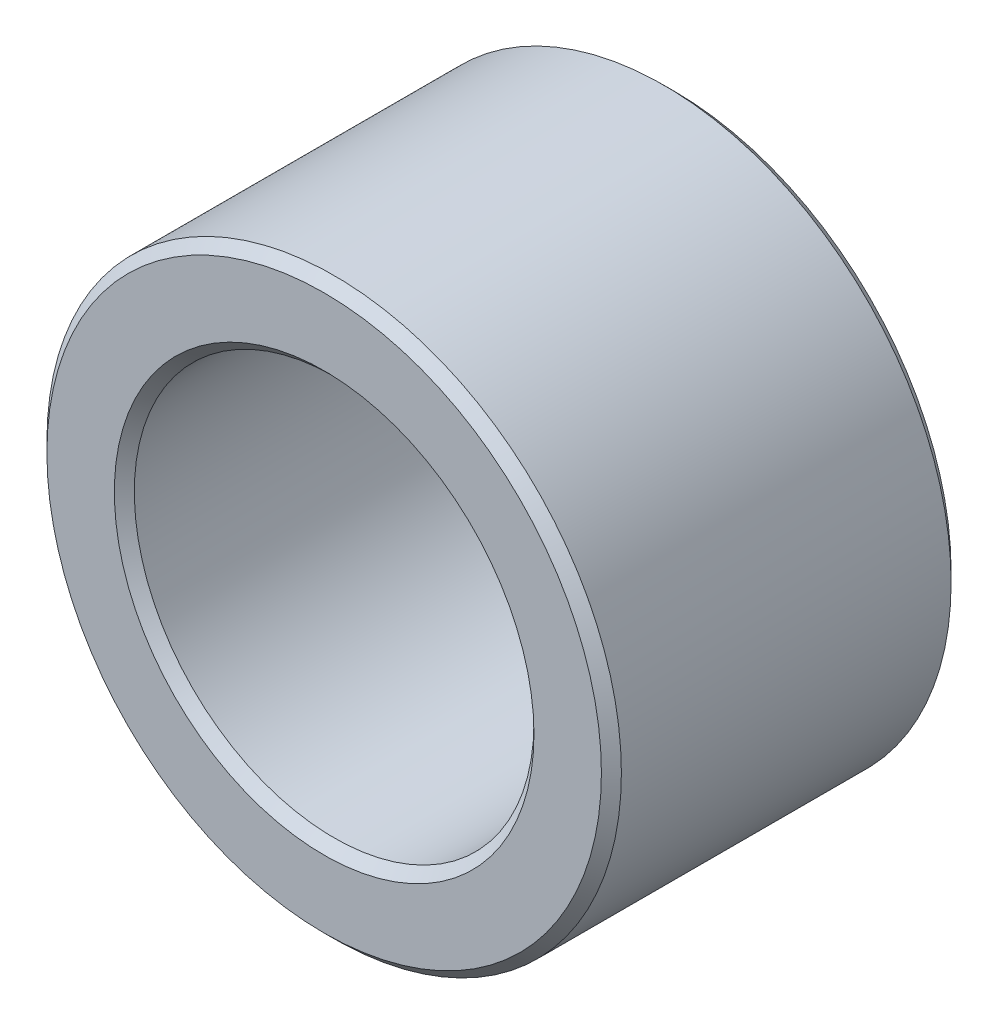
ISO-10303-21;
HEADER;
FILE_DESCRIPTION(('STEP AP214'),'2;1');
FILE_NAME('part.step','',(''),(''),'','','');
FILE_SCHEMA(('AUTOMOTIVE_DESIGN { 1 0 10303 214 1 1 1 1 }'));
ENDSEC;
DATA;
#1=APPLICATION_CONTEXT('core data for automotive mechanical design processes');
#2=APPLICATION_PROTOCOL_DEFINITION('international standard','automotive_design',2000,#1);
#3=PRODUCT_CONTEXT('',#1,'mechanical');
#4=PRODUCT('Part','Part','',(#3));
#5=PRODUCT_RELATED_PRODUCT_CATEGORY('part','',(#4));
#6=PRODUCT_DEFINITION_FORMATION('','',#4);
#7=PRODUCT_DEFINITION_CONTEXT('part definition',#1,'design');
#8=PRODUCT_DEFINITION('design','',#6,#7);
#9=PRODUCT_DEFINITION_SHAPE('','',#8);
#10=(LENGTH_UNIT() NAMED_UNIT(*) SI_UNIT(.MILLI.,.METRE.));
#11=(NAMED_UNIT(*) PLANE_ANGLE_UNIT() SI_UNIT($,.RADIAN.));
#12=(NAMED_UNIT(*) SI_UNIT($,.STERADIAN.) SOLID_ANGLE_UNIT());
#13=UNCERTAINTY_MEASURE_WITH_UNIT(LENGTH_MEASURE(1.E-05),#10,'distance_accuracy_value','');
#14=(GEOMETRIC_REPRESENTATION_CONTEXT(3) GLOBAL_UNCERTAINTY_ASSIGNED_CONTEXT((#13)) GLOBAL_UNIT_ASSIGNED_CONTEXT((#10,
#11,#12)) REPRESENTATION_CONTEXT('',''));
#15=CARTESIAN_POINT('',(0.,0.,0.));
#16=DIRECTION('',(0.,0.,1.));
#17=DIRECTION('',(1.,0.,0.));
#18=AXIS2_PLACEMENT_3D('',#15,#16,#17);
#19=CARTESIAN_POINT('',(0.,0.,-19.5));
#20=DIRECTION('',(0.,0.,-1.));
#21=DIRECTION('',(-1.,0.,0.));
#22=AXIS2_PLACEMENT_3D('',#19,#20,#21);
#23=CYLINDRICAL_SURFACE('',#22,4.);
#24=CARTESIAN_POINT('',(0.,0.,-16.1999999999694));
#25=DIRECTION('',(0.,0.,1.));
#26=DIRECTION('',(0.,1.,0.));
#27=AXIS2_PLACEMENT_3D('',#24,#25,#26);
#28=CIRCLE('',#27,3.99999999996226);
#29=CARTESIAN_POINT('',(0.,3.99999999996226,-16.1999999999694));
#30=VERTEX_POINT('',#29);
#31=EDGE_CURVE('E32',#30,#30,#28,.T.);
#32=ORIENTED_EDGE('',*,*,#31,.T.);
#33=EDGE_LOOP('',(#32));
#34=FACE_BOUND('',#33,.T.);
#35=CARTESIAN_POINT('',(0.,0.,-22.7999999999611));
#36=DIRECTION('',(0.,0.,-1.));
#37=DIRECTION('',(0.,1.,0.));
#38=AXIS2_PLACEMENT_3D('',#35,#36,#37);
#39=CIRCLE('',#38,3.99999999996226);
#40=CARTESIAN_POINT('',(0.,3.99999999996226,-22.7999999999611));
#41=VERTEX_POINT('',#40);
#42=EDGE_CURVE('E29',#41,#41,#39,.T.);
#43=ORIENTED_EDGE('',*,*,#42,.T.);
#44=EDGE_LOOP('',(#43));
#45=FACE_BOUND('',#44,.T.);
#46=ADVANCED_FACE('F14',(#34,#45),#23,.F.);
#47=CARTESIAN_POINT('',(0.,0.,-15.999999999849));
#48=DIRECTION('',(0.,0.,1.));
#49=DIRECTION('',(1.,0.,0.));
#50=AXIS2_PLACEMENT_3D('',#47,#48,#49);
#51=CONICAL_SURFACE('',#50,4.20000000002574,0.78539816325534);
#52=CARTESIAN_POINT('',(0.,0.,-15.9999999999059));
#53=DIRECTION('',(0.,0.,1.));
#54=DIRECTION('',(1.,0.,0.));
#55=AXIS2_PLACEMENT_3D('',#52,#53,#54);
#56=CIRCLE('',#55,4.1999999999689);
#57=CARTESIAN_POINT('',(4.1999999999689,0.,-15.9999999999059));
#58=VERTEX_POINT('',#57);
#59=EDGE_CURVE('E17',#58,#58,#56,.F.);
#60=ORIENTED_EDGE('',*,*,#59,.F.);
#61=EDGE_LOOP('',(#60));
#62=FACE_BOUND('',#61,.T.);
#63=ORIENTED_EDGE('',*,*,#31,.F.);
#64=EDGE_LOOP('',(#63));
#65=FACE_BOUND('',#64,.T.);
#66=ADVANCED_FACE('F49',(#62,#65),#51,.F.);
#67=CARTESIAN_POINT('',(0.,0.,-22.9999999999109));
#68=DIRECTION('',(0.,0.,-1.));
#69=DIRECTION('',(-1.,0.,0.));
#70=AXIS2_PLACEMENT_3D('',#67,#68,#69);
#71=CONICAL_SURFACE('',#70,4.19999999991205,0.785398163397448);
#72=ORIENTED_EDGE('',*,*,#42,.F.);
#73=EDGE_LOOP('',(#72));
#74=FACE_BOUND('',#73,.T.);
#75=CARTESIAN_POINT('',(0.,0.,-23.0000000000246));
#76=DIRECTION('',(0.,0.,-1.));
#77=DIRECTION('',(-1.,0.,0.));
#78=AXIS2_PLACEMENT_3D('',#75,#76,#77);
#79=CIRCLE('',#78,4.20000000002574);
#80=CARTESIAN_POINT('',(-4.20000000002574,0.,-23.0000000000246));
#81=VERTEX_POINT('',#80);
#82=EDGE_CURVE('E39',#81,#81,#79,.F.);
#83=ORIENTED_EDGE('',*,*,#82,.F.);
#84=EDGE_LOOP('',(#83));
#85=FACE_BOUND('',#84,.T.);
#86=ADVANCED_FACE('F52',(#74,#85),#71,.F.);
#87=CARTESIAN_POINT('',(0.,4.875,-16.));
#88=DIRECTION('',(0.,0.,1.));
#89=DIRECTION('',(1.,0.,0.));
#90=AXIS2_PLACEMENT_3D('',#87,#88,#89);
#91=PLANE('',#90);
#92=ORIENTED_EDGE('',*,*,#59,.T.);
#93=EDGE_LOOP('',(#92));
#94=FACE_BOUND('',#93,.T.);
#95=CARTESIAN_POINT('',(0.,0.,-16.0000000000196));
#96=DIRECTION('',(0.,0.,-1.));
#97=DIRECTION('',(-1.,0.,0.));
#98=AXIS2_PLACEMENT_3D('',#95,#96,#97);
#99=CIRCLE('',#98,5.54999999997108);
#100=CARTESIAN_POINT('',(-5.54999999997108,0.,-16.0000000000196));
#101=VERTEX_POINT('',#100);
#102=EDGE_CURVE('E37',#101,#101,#99,.T.);
#103=ORIENTED_EDGE('',*,*,#102,.F.);
#104=EDGE_LOOP('',(#103));
#105=FACE_BOUND('',#104,.T.);
#106=ADVANCED_FACE('F46',(#94,#105),#91,.T.);
#107=CARTESIAN_POINT('',(0.,4.875,-23.));
#108=DIRECTION('',(0.,0.,-1.));
#109=DIRECTION('',(-1.,0.,0.));
#110=AXIS2_PLACEMENT_3D('',#107,#108,#109);
#111=PLANE('',#110);
#112=CARTESIAN_POINT('',(0.,0.,-23.0000000000246));
#113=DIRECTION('',(0.,0.,1.));
#114=DIRECTION('',(1.,0.,0.));
#115=AXIS2_PLACEMENT_3D('',#112,#113,#114);
#116=CIRCLE('',#115,5.55000000002792);
#117=CARTESIAN_POINT('',(5.55000000002792,0.,-23.0000000000246));
#118=VERTEX_POINT('',#117);
#119=EDGE_CURVE('E26',#118,#118,#116,.T.);
#120=ORIENTED_EDGE('',*,*,#119,.F.);
#121=EDGE_LOOP('',(#120));
#122=FACE_BOUND('',#121,.T.);
#123=ORIENTED_EDGE('',*,*,#82,.T.);
#124=EDGE_LOOP('',(#123));
#125=FACE_BOUND('',#124,.T.);
#126=ADVANCED_FACE('F67',(#122,#125),#111,.T.);
#127=CARTESIAN_POINT('',(0.,0.,-16.1999999998557));
#128=DIRECTION('',(0.,0.,-1.));
#129=DIRECTION('',(-1.,0.,0.));
#130=AXIS2_PLACEMENT_3D('',#127,#128,#129);
#131=CONICAL_SURFACE('',#130,5.74999999980719,0.785398163397448);
#132=ORIENTED_EDGE('',*,*,#102,.T.);
#133=EDGE_LOOP('',(#132));
#134=FACE_BOUND('',#133,.T.);
#135=CARTESIAN_POINT('',(0.,0.,-16.2));
#136=DIRECTION('',(0.,0.,-1.));
#137=DIRECTION('',(-1.,0.,0.));
#138=AXIS2_PLACEMENT_3D('',#135,#136,#137);
#139=CIRCLE('',#138,5.75);
#140=CARTESIAN_POINT('',(-5.75,0.,-16.2));
#141=VERTEX_POINT('',#140);
#142=EDGE_CURVE('E21',#141,#141,#139,.T.);
#143=ORIENTED_EDGE('',*,*,#142,.F.);
#144=EDGE_LOOP('',(#143));
#145=FACE_BOUND('',#144,.T.);
#146=ADVANCED_FACE('F78',(#134,#145),#131,.T.);
#147=CARTESIAN_POINT('',(0.,0.,-22.8000000000179));
#148=DIRECTION('',(0.,0.,1.));
#149=DIRECTION('',(1.,0.,0.));
#150=AXIS2_PLACEMENT_3D('',#147,#148,#149);
#151=CONICAL_SURFACE('',#150,5.75000000003456,0.785398163397448);
#152=ORIENTED_EDGE('',*,*,#119,.T.);
#153=EDGE_LOOP('',(#152));
#154=FACE_BOUND('',#153,.T.);
#155=CARTESIAN_POINT('',(0.,0.,-22.8));
#156=DIRECTION('',(0.,0.,-1.));
#157=DIRECTION('',(-1.,0.,0.));
#158=AXIS2_PLACEMENT_3D('',#155,#156,#157);
#159=CIRCLE('',#158,5.75);
#160=CARTESIAN_POINT('',(-5.75,0.,-22.8));
#161=VERTEX_POINT('',#160);
#162=EDGE_CURVE('E10',#161,#161,#159,.F.);
#163=ORIENTED_EDGE('',*,*,#162,.F.);
#164=EDGE_LOOP('',(#163));
#165=FACE_BOUND('',#164,.T.);
#166=ADVANCED_FACE('F71',(#154,#165),#151,.T.);
#167=CARTESIAN_POINT('',(0.,0.,-19.5));
#168=DIRECTION('',(0.,0.,-1.));
#169=DIRECTION('',(-1.,0.,0.));
#170=AXIS2_PLACEMENT_3D('',#167,#168,#169);
#171=CYLINDRICAL_SURFACE('',#170,5.75);
#172=ORIENTED_EDGE('',*,*,#142,.T.);
#173=EDGE_LOOP('',(#172));
#174=FACE_BOUND('',#173,.T.);
#175=ORIENTED_EDGE('',*,*,#162,.T.);
#176=EDGE_LOOP('',(#175));
#177=FACE_BOUND('',#176,.T.);
#178=ADVANCED_FACE('F69',(#174,#177),#171,.T.);
#179=CLOSED_SHELL('',(#46,#66,#86,#106,#126,#146,#166,#178));
#180=MANIFOLD_SOLID_BREP('B1',#179);
#181=ADVANCED_BREP_SHAPE_REPRESENTATION('',(#18,#180),#14);
#182=SHAPE_DEFINITION_REPRESENTATION(#9,#181);
ENDSEC;
END-ISO-10303-21;
